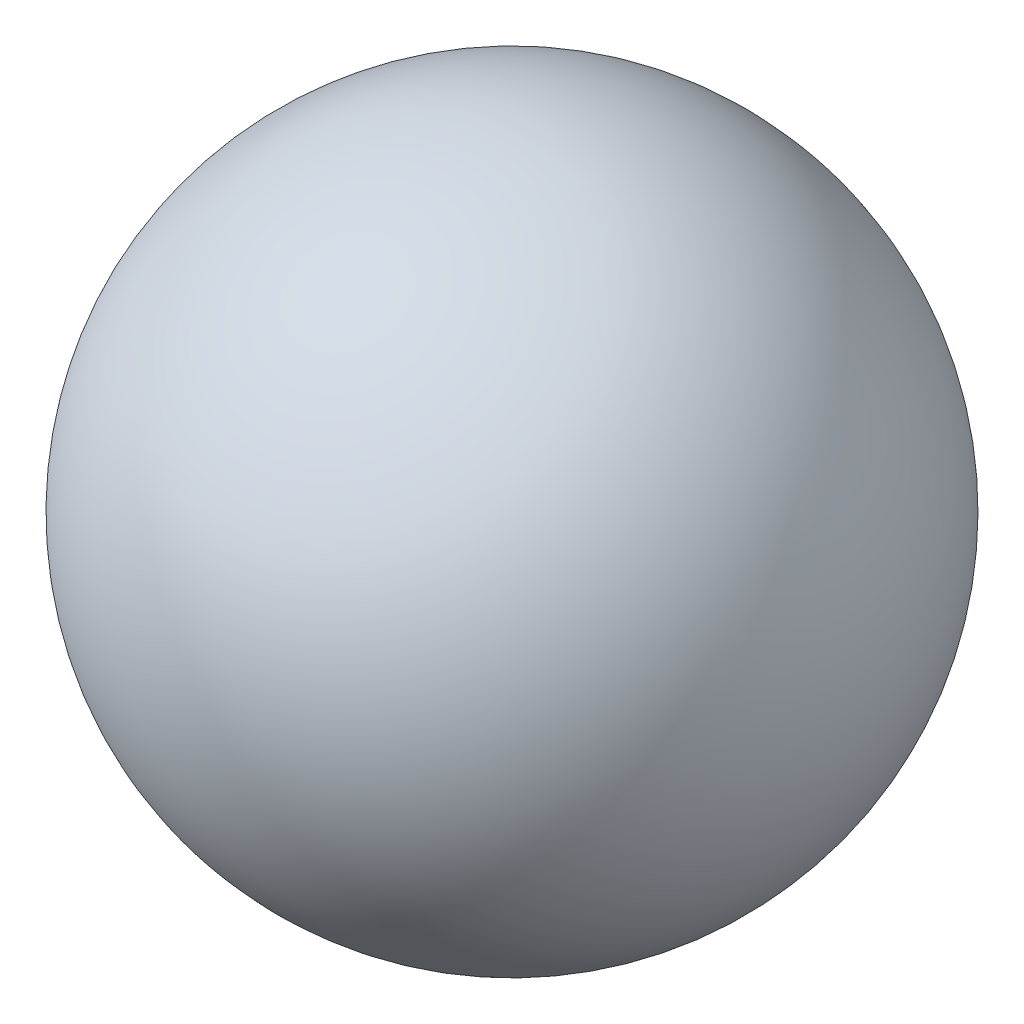
ISO-10303-21;
HEADER;
FILE_DESCRIPTION(('STEP AP214'),'2;1');
FILE_NAME('part.step','',(''),(''),'','','');
FILE_SCHEMA(('AUTOMOTIVE_DESIGN { 1 0 10303 214 1 1 1 1 }'));
ENDSEC;
DATA;
#1=APPLICATION_CONTEXT('core data for automotive mechanical design processes');
#2=APPLICATION_PROTOCOL_DEFINITION('international standard','automotive_design',2000,#1);
#3=PRODUCT_CONTEXT('',#1,'mechanical');
#4=PRODUCT('Part','Part','',(#3));
#5=PRODUCT_RELATED_PRODUCT_CATEGORY('part','',(#4));
#6=PRODUCT_DEFINITION_FORMATION('','',#4);
#7=PRODUCT_DEFINITION_CONTEXT('part definition',#1,'design');
#8=PRODUCT_DEFINITION('design','',#6,#7);
#9=PRODUCT_DEFINITION_SHAPE('','',#8);
#10=(LENGTH_UNIT() NAMED_UNIT(*) SI_UNIT(.MILLI.,.METRE.));
#11=(NAMED_UNIT(*) PLANE_ANGLE_UNIT() SI_UNIT($,.RADIAN.));
#12=(NAMED_UNIT(*) SI_UNIT($,.STERADIAN.) SOLID_ANGLE_UNIT());
#13=UNCERTAINTY_MEASURE_WITH_UNIT(LENGTH_MEASURE(1.E-05),#10,'distance_accuracy_value','');
#14=(GEOMETRIC_REPRESENTATION_CONTEXT(3) GLOBAL_UNCERTAINTY_ASSIGNED_CONTEXT((#13)) GLOBAL_UNIT_ASSIGNED_CONTEXT((#10,
#11,#12)) REPRESENTATION_CONTEXT('',''));
#15=CARTESIAN_POINT('',(0.,0.,0.));
#16=DIRECTION('',(0.,0.,1.));
#17=DIRECTION('',(1.,0.,0.));
#18=AXIS2_PLACEMENT_3D('',#15,#16,#17);
#19=CARTESIAN_POINT('',(64.16,-28.1965571573831,63.3952273713919));
#20=DIRECTION('',(0.,-0.406389996935609,0.913699715656456));
#21=DIRECTION('',(0.173648177666934,-0.899818563903521,-0.400216019728792));
#22=AXIS2_PLACEMENT_3D('',#19,#20,#21);
#23=SPHERICAL_SURFACE('',#22,7.15);
#24=CARTESIAN_POINT('',(64.16,-31.1022456354727,69.9281803383355));
#25=VERTEX_POINT('',#24);
#26=VERTEX_LOOP('',#25);
#27=FACE_BOUND('',#26,.T.);
#28=CARTESIAN_POINT('',(64.16,-25.2908686792935,56.8622744044482));
#29=VERTEX_POINT('',#28);
#30=VERTEX_LOOP('',#29);
#31=FACE_BOUND('',#30,.T.);
#32=ADVANCED_FACE('F23',(#27,#31),#23,.T.);
#33=CLOSED_SHELL('',(#32));
#34=MANIFOLD_SOLID_BREP('B1',#33);
#35=ADVANCED_BREP_SHAPE_REPRESENTATION('',(#18,#34),#14);
#36=SHAPE_DEFINITION_REPRESENTATION(#9,#35);
ENDSEC;
END-ISO-10303-21;
